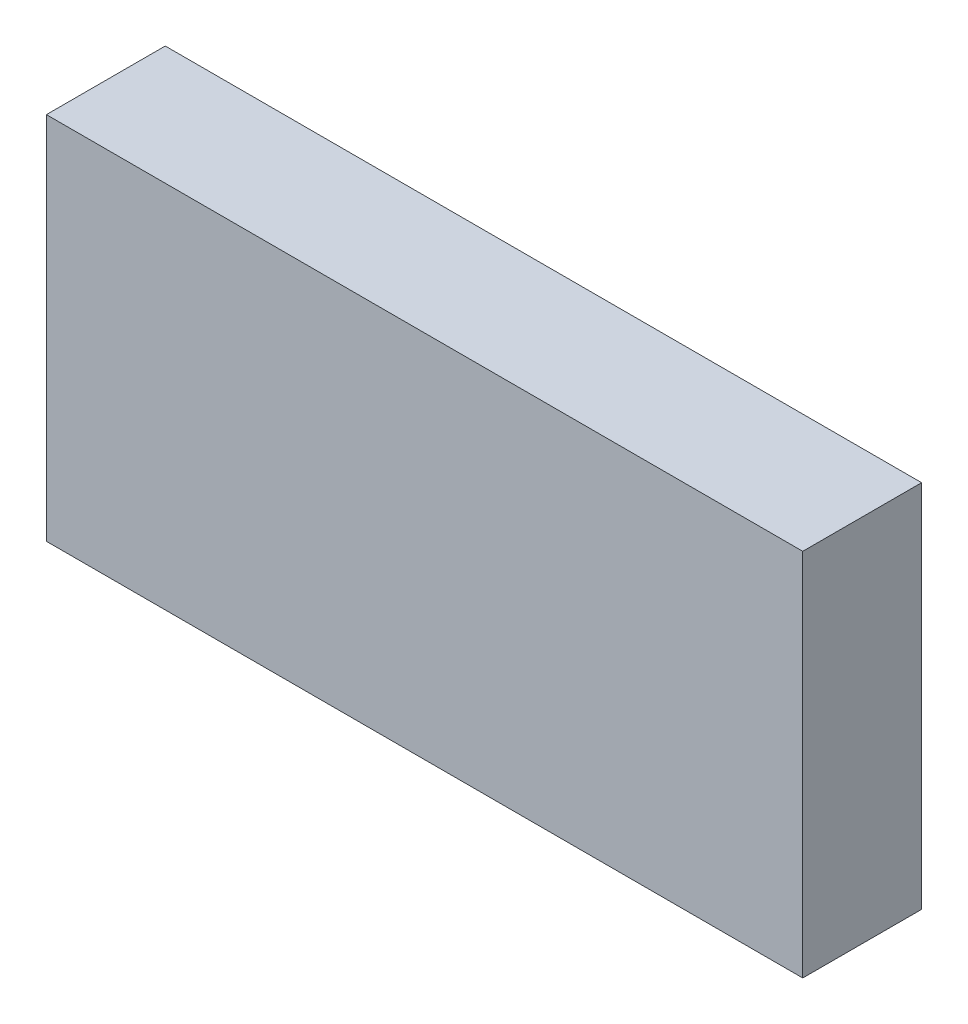
ISO-10303-21;
HEADER;
FILE_DESCRIPTION(('STEP AP214'),'2;1');
FILE_NAME('part.step','',(''),(''),'','','');
FILE_SCHEMA(('AUTOMOTIVE_DESIGN { 1 0 10303 214 1 1 1 1 }'));
ENDSEC;
DATA;
#1=APPLICATION_CONTEXT('core data for automotive mechanical design processes');
#2=APPLICATION_PROTOCOL_DEFINITION('international standard','automotive_design',2000,#1);
#3=PRODUCT_CONTEXT('',#1,'mechanical');
#4=PRODUCT('Part','Part','',(#3));
#5=PRODUCT_RELATED_PRODUCT_CATEGORY('part','',(#4));
#6=PRODUCT_DEFINITION_FORMATION('','',#4);
#7=PRODUCT_DEFINITION_CONTEXT('part definition',#1,'design');
#8=PRODUCT_DEFINITION('design','',#6,#7);
#9=PRODUCT_DEFINITION_SHAPE('','',#8);
#10=(LENGTH_UNIT() NAMED_UNIT(*) SI_UNIT(.MILLI.,.METRE.));
#11=(NAMED_UNIT(*) PLANE_ANGLE_UNIT() SI_UNIT($,.RADIAN.));
#12=(NAMED_UNIT(*) SI_UNIT($,.STERADIAN.) SOLID_ANGLE_UNIT());
#13=UNCERTAINTY_MEASURE_WITH_UNIT(LENGTH_MEASURE(1.E-05),#10,'distance_accuracy_value','');
#14=(GEOMETRIC_REPRESENTATION_CONTEXT(3) GLOBAL_UNCERTAINTY_ASSIGNED_CONTEXT((#13)) GLOBAL_UNIT_ASSIGNED_CONTEXT((#10,
#11,#12)) REPRESENTATION_CONTEXT('',''));
#15=CARTESIAN_POINT('',(0.,0.,0.));
#16=DIRECTION('',(0.,0.,1.));
#17=DIRECTION('',(1.,0.,0.));
#18=AXIS2_PLACEMENT_3D('',#15,#16,#17);
#19=CARTESIAN_POINT('',(-17.5,8.55,5.5));
#20=DIRECTION('',(1.,0.,0.));
#21=DIRECTION('',(0.,1.,0.));
#22=AXIS2_PLACEMENT_3D('',#19,#20,#21);
#23=PLANE('',#22);
#24=DIRECTION('',(0.,-1.,0.));
#25=VECTOR('',#24,1.);
#26=CARTESIAN_POINT('',(-17.5,8.55,0.));
#27=LINE('',#26,#25);
#28=CARTESIAN_POINT('',(-17.5,8.55,0.));
#29=VERTEX_POINT('',#28);
#30=CARTESIAN_POINT('',(-17.5,-8.55,0.));
#31=VERTEX_POINT('',#30);
#32=EDGE_CURVE('E111',#29,#31,#27,.T.);
#33=ORIENTED_EDGE('',*,*,#32,.T.);
#34=DIRECTION('',(0.,0.,-1.));
#35=VECTOR('',#34,1.);
#36=CARTESIAN_POINT('',(-17.5,-8.55,5.5));
#37=LINE('',#36,#35);
#38=CARTESIAN_POINT('',(-17.5,-8.55,5.5));
#39=VERTEX_POINT('',#38);
#40=EDGE_CURVE('E11',#39,#31,#37,.T.);
#41=ORIENTED_EDGE('',*,*,#40,.F.);
#42=DIRECTION('',(0.,-1.,0.));
#43=VECTOR('',#42,1.);
#44=CARTESIAN_POINT('',(-17.5,8.55,5.5));
#45=LINE('',#44,#43);
#46=CARTESIAN_POINT('',(-17.5,8.55,5.5));
#47=VERTEX_POINT('',#46);
#48=EDGE_CURVE('E95',#47,#39,#45,.T.);
#49=ORIENTED_EDGE('',*,*,#48,.F.);
#50=DIRECTION('',(0.,0.,-1.));
#51=VECTOR('',#50,1.);
#52=CARTESIAN_POINT('',(-17.5,8.55,5.5));
#53=LINE('',#52,#51);
#54=EDGE_CURVE('E107',#47,#29,#53,.T.);
#55=ORIENTED_EDGE('',*,*,#54,.T.);
#56=EDGE_LOOP('',(#33,#41,#49,#55));
#57=FACE_BOUND('',#56,.T.);
#58=ADVANCED_FACE('F43',(#57),#23,.F.);
#59=CARTESIAN_POINT('',(-17.5,-8.55,5.5));
#60=DIRECTION('',(0.,1.,0.));
#61=DIRECTION('',(0.,0.,1.));
#62=AXIS2_PLACEMENT_3D('',#59,#60,#61);
#63=PLANE('',#62);
#64=DIRECTION('',(1.,0.,0.));
#65=VECTOR('',#64,1.);
#66=CARTESIAN_POINT('',(-17.5,-8.55,0.));
#67=LINE('',#66,#65);
#68=CARTESIAN_POINT('',(17.5,-8.55,0.));
#69=VERTEX_POINT('',#68);
#70=EDGE_CURVE('E100',#31,#69,#67,.T.);
#71=ORIENTED_EDGE('',*,*,#70,.T.);
#72=DIRECTION('',(0.,0.,-1.));
#73=VECTOR('',#72,1.);
#74=CARTESIAN_POINT('',(17.5,-8.55,5.5));
#75=LINE('',#74,#73);
#76=CARTESIAN_POINT('',(17.5,-8.55,5.5));
#77=VERTEX_POINT('',#76);
#78=EDGE_CURVE('E52',#77,#69,#75,.T.);
#79=ORIENTED_EDGE('',*,*,#78,.F.);
#80=DIRECTION('',(1.,0.,0.));
#81=VECTOR('',#80,1.);
#82=CARTESIAN_POINT('',(-17.5,-8.55,5.5));
#83=LINE('',#82,#81);
#84=EDGE_CURVE('E90',#39,#77,#83,.T.);
#85=ORIENTED_EDGE('',*,*,#84,.F.);
#86=ORIENTED_EDGE('',*,*,#40,.T.);
#87=EDGE_LOOP('',(#71,#79,#85,#86));
#88=FACE_BOUND('',#87,.T.);
#89=ADVANCED_FACE('F99',(#88),#63,.F.);
#90=CARTESIAN_POINT('',(17.5,8.55,5.5));
#91=DIRECTION('',(-1.,0.,0.));
#92=DIRECTION('',(0.,-1.,0.));
#93=AXIS2_PLACEMENT_3D('',#90,#91,#92);
#94=PLANE('',#93);
#95=DIRECTION('',(0.,1.,0.));
#96=VECTOR('',#95,1.);
#97=CARTESIAN_POINT('',(17.5,8.55,0.));
#98=LINE('',#97,#96);
#99=CARTESIAN_POINT('',(17.5,8.55,0.));
#100=VERTEX_POINT('',#99);
#101=EDGE_CURVE('E77',#69,#100,#98,.T.);
#102=ORIENTED_EDGE('',*,*,#101,.T.);
#103=DIRECTION('',(0.,0.,-1.));
#104=VECTOR('',#103,1.);
#105=CARTESIAN_POINT('',(17.5,8.55,5.5));
#106=LINE('',#105,#104);
#107=CARTESIAN_POINT('',(17.5,8.55,5.5));
#108=VERTEX_POINT('',#107);
#109=EDGE_CURVE('E102',#108,#100,#106,.T.);
#110=ORIENTED_EDGE('',*,*,#109,.F.);
#111=DIRECTION('',(0.,1.,0.));
#112=VECTOR('',#111,1.);
#113=CARTESIAN_POINT('',(17.5,8.55,5.5));
#114=LINE('',#113,#112);
#115=EDGE_CURVE('E93',#77,#108,#114,.T.);
#116=ORIENTED_EDGE('',*,*,#115,.F.);
#117=ORIENTED_EDGE('',*,*,#78,.T.);
#118=EDGE_LOOP('',(#102,#110,#116,#117));
#119=FACE_BOUND('',#118,.T.);
#120=ADVANCED_FACE('F103',(#119),#94,.F.);
#121=CARTESIAN_POINT('',(-17.5,8.55,5.5));
#122=DIRECTION('',(0.,-1.,0.));
#123=DIRECTION('',(0.,0.,-1.));
#124=AXIS2_PLACEMENT_3D('',#121,#122,#123);
#125=PLANE('',#124);
#126=DIRECTION('',(-1.,0.,0.));
#127=VECTOR('',#126,1.);
#128=CARTESIAN_POINT('',(-17.5,8.55,0.));
#129=LINE('',#128,#127);
#130=EDGE_CURVE('E83',#100,#29,#129,.T.);
#131=ORIENTED_EDGE('',*,*,#130,.T.);
#132=ORIENTED_EDGE('',*,*,#54,.F.);
#133=DIRECTION('',(-1.,0.,0.));
#134=VECTOR('',#133,1.);
#135=CARTESIAN_POINT('',(-17.5,8.55,5.5));
#136=LINE('',#135,#134);
#137=EDGE_CURVE('E60',#108,#47,#136,.T.);
#138=ORIENTED_EDGE('',*,*,#137,.F.);
#139=ORIENTED_EDGE('',*,*,#109,.T.);
#140=EDGE_LOOP('',(#131,#132,#138,#139));
#141=FACE_BOUND('',#140,.T.);
#142=ADVANCED_FACE('F124',(#141),#125,.F.);
#143=CARTESIAN_POINT('',(0.,0.,5.5));
#144=DIRECTION('',(0.,0.,1.));
#145=DIRECTION('',(1.,0.,0.));
#146=AXIS2_PLACEMENT_3D('',#143,#144,#145);
#147=PLANE('',#146);
#148=ORIENTED_EDGE('',*,*,#48,.T.);
#149=ORIENTED_EDGE('',*,*,#84,.T.);
#150=ORIENTED_EDGE('',*,*,#115,.T.);
#151=ORIENTED_EDGE('',*,*,#137,.T.);
#152=EDGE_LOOP('',(#148,#149,#150,#151));
#153=FACE_BOUND('',#152,.T.);
#154=ADVANCED_FACE('F91',(#153),#147,.T.);
#155=CARTESIAN_POINT('',(0.,0.,0.));
#156=DIRECTION('',(0.,0.,1.));
#157=DIRECTION('',(1.,0.,0.));
#158=AXIS2_PLACEMENT_3D('',#155,#156,#157);
#159=PLANE('',#158);
#160=ORIENTED_EDGE('',*,*,#32,.F.);
#161=ORIENTED_EDGE('',*,*,#130,.F.);
#162=ORIENTED_EDGE('',*,*,#101,.F.);
#163=ORIENTED_EDGE('',*,*,#70,.F.);
#164=EDGE_LOOP('',(#160,#161,#162,#163));
#165=FACE_BOUND('',#164,.T.);
#166=ADVANCED_FACE('F127',(#165),#159,.F.);
#167=CLOSED_SHELL('',(#58,#89,#120,#142,#154,#166));
#168=MANIFOLD_SOLID_BREP('B2',#167);
#169=ADVANCED_BREP_SHAPE_REPRESENTATION('',(#18,#168),#14);
#170=SHAPE_DEFINITION_REPRESENTATION(#9,#169);
ENDSEC;
END-ISO-10303-21;
